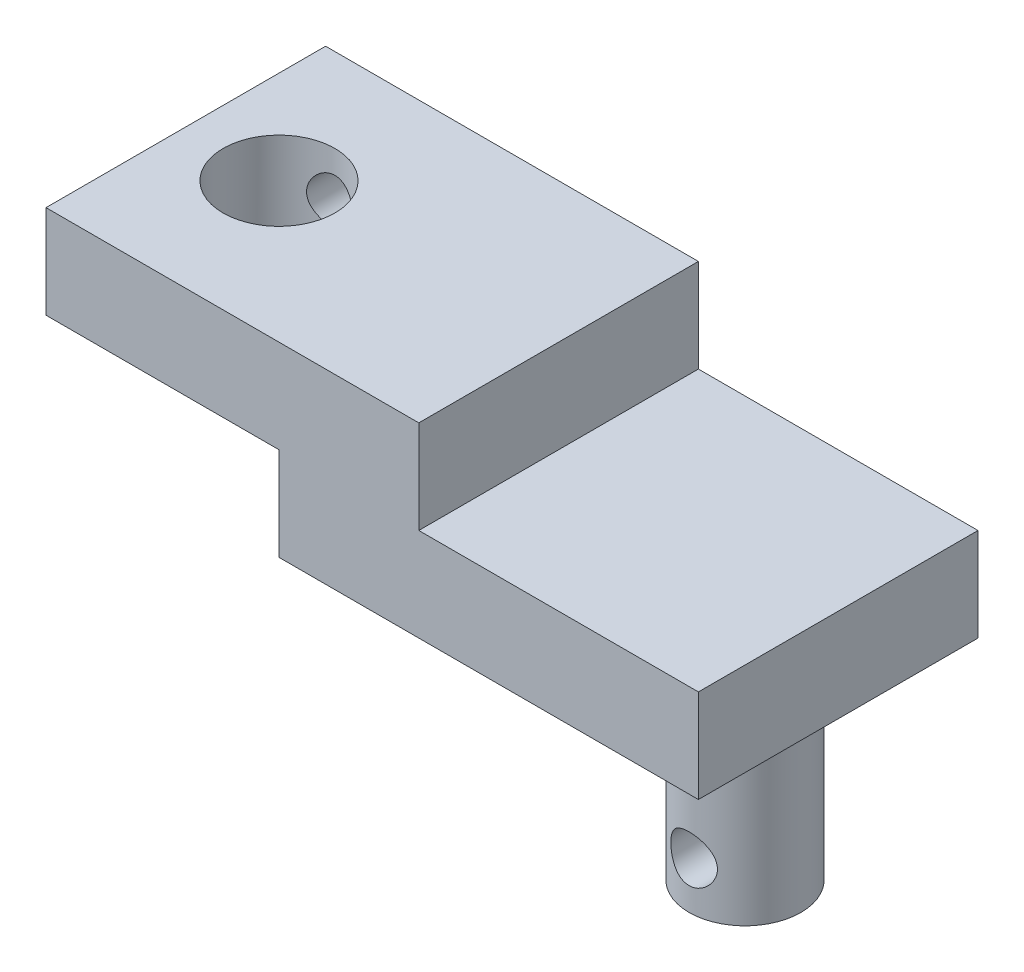
ISO-10303-21;
HEADER;
FILE_DESCRIPTION(('STEP AP214'),'2;1');
FILE_NAME('part.step','',(''),(''),'','','');
FILE_SCHEMA(('AUTOMOTIVE_DESIGN { 1 0 10303 214 1 1 1 1 }'));
ENDSEC;
DATA;
#1=APPLICATION_CONTEXT('core data for automotive mechanical design processes');
#2=APPLICATION_PROTOCOL_DEFINITION('international standard','automotive_design',2000,#1);
#3=PRODUCT_CONTEXT('',#1,'mechanical');
#4=PRODUCT('Part','Part','',(#3));
#5=PRODUCT_RELATED_PRODUCT_CATEGORY('part','',(#4));
#6=PRODUCT_DEFINITION_FORMATION('','',#4);
#7=PRODUCT_DEFINITION_CONTEXT('part definition',#1,'design');
#8=PRODUCT_DEFINITION('design','',#6,#7);
#9=PRODUCT_DEFINITION_SHAPE('','',#8);
#10=(LENGTH_UNIT() NAMED_UNIT(*) SI_UNIT(.MILLI.,.METRE.));
#11=(NAMED_UNIT(*) PLANE_ANGLE_UNIT() SI_UNIT($,.RADIAN.));
#12=(NAMED_UNIT(*) SI_UNIT($,.STERADIAN.) SOLID_ANGLE_UNIT());
#13=UNCERTAINTY_MEASURE_WITH_UNIT(LENGTH_MEASURE(1.E-05),#10,'distance_accuracy_value','');
#14=(GEOMETRIC_REPRESENTATION_CONTEXT(3) GLOBAL_UNCERTAINTY_ASSIGNED_CONTEXT((#13)) GLOBAL_UNIT_ASSIGNED_CONTEXT((#10,
#11,#12)) REPRESENTATION_CONTEXT('',''));
#15=CARTESIAN_POINT('',(0.,0.,0.));
#16=DIRECTION('',(0.,0.,1.));
#17=DIRECTION('',(1.,0.,0.));
#18=AXIS2_PLACEMENT_3D('',#15,#16,#17);
#19=CARTESIAN_POINT('',(-15.,-10.,15.));
#20=DIRECTION('',(0.,1.,0.));
#21=DIRECTION('',(0.,0.,1.));
#22=AXIS2_PLACEMENT_3D('',#19,#20,#21);
#23=PLANE('',#22);
#24=DIRECTION('',(1.,0.,0.));
#25=VECTOR('',#24,1.);
#26=CARTESIAN_POINT('',(-15.,-10.,-15.));
#27=LINE('',#26,#25);
#28=CARTESIAN_POINT('',(-15.,-10.,-15.));
#29=VERTEX_POINT('',#28);
#30=CARTESIAN_POINT('',(30.,-10.,-15.));
#31=VERTEX_POINT('',#30);
#32=EDGE_CURVE('E147',#29,#31,#27,.T.);
#33=ORIENTED_EDGE('',*,*,#32,.T.);
#34=DIRECTION('',(0.,0.,-1.));
#35=VECTOR('',#34,1.);
#36=CARTESIAN_POINT('',(30.,-10.,15.));
#37=LINE('',#36,#35);
#38=CARTESIAN_POINT('',(30.,-10.,15.));
#39=VERTEX_POINT('',#38);
#40=EDGE_CURVE('E158',#39,#31,#37,.T.);
#41=ORIENTED_EDGE('',*,*,#40,.F.);
#42=DIRECTION('',(1.,0.,0.));
#43=VECTOR('',#42,1.);
#44=CARTESIAN_POINT('',(-15.,-10.,15.));
#45=LINE('',#44,#43);
#46=CARTESIAN_POINT('',(-15.,-10.,15.));
#47=VERTEX_POINT('',#46);
#48=EDGE_CURVE('E238',#47,#39,#45,.T.);
#49=ORIENTED_EDGE('',*,*,#48,.F.);
#50=DIRECTION('',(0.,0.,-1.));
#51=VECTOR('',#50,1.);
#52=CARTESIAN_POINT('',(-15.,-10.,15.));
#53=LINE('',#52,#51);
#54=EDGE_CURVE('E161',#47,#29,#53,.T.);
#55=ORIENTED_EDGE('',*,*,#54,.T.);
#56=EDGE_LOOP('',(#33,#41,#49,#55));
#57=FACE_BOUND('',#56,.T.);
#58=CARTESIAN_POINT('',(20.,-10.,0.));
#59=DIRECTION('',(0.,1.,0.));
#60=DIRECTION('',(0.,0.,1.));
#61=AXIS2_PLACEMENT_3D('',#58,#59,#60);
#62=CIRCLE('',#61,6.);
#63=CARTESIAN_POINT('',(20.,-10.,6.));
#64=VERTEX_POINT('',#63);
#65=EDGE_CURVE('E11',#64,#64,#62,.F.);
#66=ORIENTED_EDGE('',*,*,#65,.F.);
#67=EDGE_LOOP('',(#66));
#68=FACE_BOUND('',#67,.T.);
#69=ADVANCED_FACE('F35',(#57,#68),#23,.F.);
#70=CARTESIAN_POINT('',(-40.,10.,15.));
#71=DIRECTION('',(1.,0.,0.));
#72=DIRECTION('',(0.,0.,-1.));
#73=AXIS2_PLACEMENT_3D('',#70,#71,#72);
#74=PLANE('',#73);
#75=DIRECTION('',(0.,-1.,0.));
#76=VECTOR('',#75,1.);
#77=CARTESIAN_POINT('',(-40.,10.,-15.));
#78=LINE('',#77,#76);
#79=CARTESIAN_POINT('',(-40.,10.,-15.));
#80=VERTEX_POINT('',#79);
#81=CARTESIAN_POINT('',(-40.,0.,-15.));
#82=VERTEX_POINT('',#81);
#83=EDGE_CURVE('E139',#80,#82,#78,.T.);
#84=ORIENTED_EDGE('',*,*,#83,.T.);
#85=DIRECTION('',(0.,0.,-1.));
#86=VECTOR('',#85,1.);
#87=CARTESIAN_POINT('',(-40.,0.,15.));
#88=LINE('',#87,#86);
#89=CARTESIAN_POINT('',(-40.,0.,15.));
#90=VERTEX_POINT('',#89);
#91=EDGE_CURVE('E49',#90,#82,#88,.T.);
#92=ORIENTED_EDGE('',*,*,#91,.F.);
#93=DIRECTION('',(0.,-1.,0.));
#94=VECTOR('',#93,1.);
#95=CARTESIAN_POINT('',(-40.,10.,15.));
#96=LINE('',#95,#94);
#97=CARTESIAN_POINT('',(-40.,10.,15.));
#98=VERTEX_POINT('',#97);
#99=EDGE_CURVE('E154',#98,#90,#96,.T.);
#100=ORIENTED_EDGE('',*,*,#99,.F.);
#101=DIRECTION('',(0.,0.,-1.));
#102=VECTOR('',#101,1.);
#103=CARTESIAN_POINT('',(-40.,10.,15.));
#104=LINE('',#103,#102);
#105=EDGE_CURVE('E135',#98,#80,#104,.T.);
#106=ORIENTED_EDGE('',*,*,#105,.T.);
#107=EDGE_LOOP('',(#84,#92,#100,#106));
#108=FACE_BOUND('',#107,.T.);
#109=ADVANCED_FACE('F37',(#108),#74,.F.);
#110=CARTESIAN_POINT('',(-40.,0.,15.));
#111=DIRECTION('',(0.,1.,0.));
#112=DIRECTION('',(-1.,0.,0.));
#113=AXIS2_PLACEMENT_3D('',#110,#111,#112);
#114=PLANE('',#113);
#115=CARTESIAN_POINT('',(-30.,0.,0.));
#116=DIRECTION('',(0.,1.,0.));
#117=DIRECTION('',(-1.,0.,0.));
#118=AXIS2_PLACEMENT_3D('',#115,#116,#117);
#119=CIRCLE('',#118,6.);
#120=CARTESIAN_POINT('',(-36.,0.,0.));
#121=VERTEX_POINT('',#120);
#122=EDGE_CURVE('E143',#121,#121,#119,.F.);
#123=ORIENTED_EDGE('',*,*,#122,.F.);
#124=EDGE_LOOP('',(#123));
#125=FACE_BOUND('',#124,.T.);
#126=DIRECTION('',(1.,0.,0.));
#127=VECTOR('',#126,1.);
#128=CARTESIAN_POINT('',(-40.,0.,-15.));
#129=LINE('',#128,#127);
#130=CARTESIAN_POINT('',(-15.,0.,-15.));
#131=VERTEX_POINT('',#130);
#132=EDGE_CURVE('E142',#82,#131,#129,.T.);
#133=ORIENTED_EDGE('',*,*,#132,.T.);
#134=DIRECTION('',(0.,0.,-1.));
#135=VECTOR('',#134,1.);
#136=CARTESIAN_POINT('',(-15.,0.,15.));
#137=LINE('',#136,#135);
#138=CARTESIAN_POINT('',(-15.,0.,15.));
#139=VERTEX_POINT('',#138);
#140=EDGE_CURVE('E164',#139,#131,#137,.T.);
#141=ORIENTED_EDGE('',*,*,#140,.F.);
#142=DIRECTION('',(1.,0.,0.));
#143=VECTOR('',#142,1.);
#144=CARTESIAN_POINT('',(-40.,0.,15.));
#145=LINE('',#144,#143);
#146=EDGE_CURVE('E102',#90,#139,#145,.T.);
#147=ORIENTED_EDGE('',*,*,#146,.F.);
#148=ORIENTED_EDGE('',*,*,#91,.T.);
#149=EDGE_LOOP('',(#133,#141,#147,#148));
#150=FACE_BOUND('',#149,.T.);
#151=ADVANCED_FACE('F210',(#125,#150),#114,.F.);
#152=CARTESIAN_POINT('',(-15.,0.,15.));
#153=DIRECTION('',(1.,0.,0.));
#154=DIRECTION('',(0.,1.,0.));
#155=AXIS2_PLACEMENT_3D('',#152,#153,#154);
#156=PLANE('',#155);
#157=DIRECTION('',(0.,-1.,0.));
#158=VECTOR('',#157,1.);
#159=CARTESIAN_POINT('',(-15.,0.,-15.));
#160=LINE('',#159,#158);
#161=EDGE_CURVE('E145',#131,#29,#160,.T.);
#162=ORIENTED_EDGE('',*,*,#161,.T.);
#163=ORIENTED_EDGE('',*,*,#54,.F.);
#164=DIRECTION('',(0.,-1.,0.));
#165=VECTOR('',#164,1.);
#166=CARTESIAN_POINT('',(-15.,0.,15.));
#167=LINE('',#166,#165);
#168=EDGE_CURVE('E232',#139,#47,#167,.T.);
#169=ORIENTED_EDGE('',*,*,#168,.F.);
#170=ORIENTED_EDGE('',*,*,#140,.T.);
#171=EDGE_LOOP('',(#162,#163,#169,#170));
#172=FACE_BOUND('',#171,.T.);
#173=ADVANCED_FACE('F217',(#172),#156,.F.);
#174=CARTESIAN_POINT('',(30.,0.,15.));
#175=DIRECTION('',(-1.,0.,0.));
#176=DIRECTION('',(0.,0.,1.));
#177=AXIS2_PLACEMENT_3D('',#174,#175,#176);
#178=PLANE('',#177);
#179=DIRECTION('',(0.,1.,0.));
#180=VECTOR('',#179,1.);
#181=CARTESIAN_POINT('',(30.,0.,-15.));
#182=LINE('',#181,#180);
#183=CARTESIAN_POINT('',(30.,0.,-15.));
#184=VERTEX_POINT('',#183);
#185=EDGE_CURVE('E149',#31,#184,#182,.T.);
#186=ORIENTED_EDGE('',*,*,#185,.T.);
#187=DIRECTION('',(0.,0.,-1.));
#188=VECTOR('',#187,1.);
#189=CARTESIAN_POINT('',(30.,0.,15.));
#190=LINE('',#189,#188);
#191=CARTESIAN_POINT('',(30.,0.,15.));
#192=VERTEX_POINT('',#191);
#193=EDGE_CURVE('E130',#192,#184,#190,.T.);
#194=ORIENTED_EDGE('',*,*,#193,.F.);
#195=DIRECTION('',(0.,1.,0.));
#196=VECTOR('',#195,1.);
#197=CARTESIAN_POINT('',(30.,0.,15.));
#198=LINE('',#197,#196);
#199=EDGE_CURVE('E121',#39,#192,#198,.T.);
#200=ORIENTED_EDGE('',*,*,#199,.F.);
#201=ORIENTED_EDGE('',*,*,#40,.T.);
#202=EDGE_LOOP('',(#186,#194,#200,#201));
#203=FACE_BOUND('',#202,.T.);
#204=ADVANCED_FACE('F215',(#203),#178,.F.);
#205=CARTESIAN_POINT('',(0.,0.,15.));
#206=DIRECTION('',(0.,-1.,0.));
#207=DIRECTION('',(0.,0.,-1.));
#208=AXIS2_PLACEMENT_3D('',#205,#206,#207);
#209=PLANE('',#208);
#210=DIRECTION('',(-1.,0.,0.));
#211=VECTOR('',#210,1.);
#212=CARTESIAN_POINT('',(0.,0.,-15.));
#213=LINE('',#212,#211);
#214=CARTESIAN_POINT('',(0.,0.,-15.));
#215=VERTEX_POINT('',#214);
#216=EDGE_CURVE('E129',#184,#215,#213,.T.);
#217=ORIENTED_EDGE('',*,*,#216,.T.);
#218=DIRECTION('',(0.,0.,-1.));
#219=VECTOR('',#218,1.);
#220=CARTESIAN_POINT('',(0.,0.,15.));
#221=LINE('',#220,#219);
#222=CARTESIAN_POINT('',(0.,0.,15.));
#223=VERTEX_POINT('',#222);
#224=EDGE_CURVE('E126',#223,#215,#221,.T.);
#225=ORIENTED_EDGE('',*,*,#224,.F.);
#226=DIRECTION('',(-1.,0.,0.));
#227=VECTOR('',#226,1.);
#228=CARTESIAN_POINT('',(0.,0.,15.));
#229=LINE('',#228,#227);
#230=EDGE_CURVE('E115',#192,#223,#229,.T.);
#231=ORIENTED_EDGE('',*,*,#230,.F.);
#232=ORIENTED_EDGE('',*,*,#193,.T.);
#233=EDGE_LOOP('',(#217,#225,#231,#232));
#234=FACE_BOUND('',#233,.T.);
#235=ADVANCED_FACE('F127',(#234),#209,.F.);
#236=CARTESIAN_POINT('',(0.,10.,15.));
#237=DIRECTION('',(-1.,0.,0.));
#238=DIRECTION('',(0.,-1.,0.));
#239=AXIS2_PLACEMENT_3D('',#236,#237,#238);
#240=PLANE('',#239);
#241=DIRECTION('',(0.,1.,0.));
#242=VECTOR('',#241,1.);
#243=CARTESIAN_POINT('',(0.,10.,-15.));
#244=LINE('',#243,#242);
#245=CARTESIAN_POINT('',(0.,10.,-15.));
#246=VERTEX_POINT('',#245);
#247=EDGE_CURVE('E87',#215,#246,#244,.T.);
#248=ORIENTED_EDGE('',*,*,#247,.T.);
#249=DIRECTION('',(0.,0.,-1.));
#250=VECTOR('',#249,1.);
#251=CARTESIAN_POINT('',(0.,10.,15.));
#252=LINE('',#251,#250);
#253=CARTESIAN_POINT('',(0.,10.,15.));
#254=VERTEX_POINT('',#253);
#255=EDGE_CURVE('E131',#254,#246,#252,.T.);
#256=ORIENTED_EDGE('',*,*,#255,.F.);
#257=DIRECTION('',(0.,1.,0.));
#258=VECTOR('',#257,1.);
#259=CARTESIAN_POINT('',(0.,10.,15.));
#260=LINE('',#259,#258);
#261=EDGE_CURVE('E119',#223,#254,#260,.T.);
#262=ORIENTED_EDGE('',*,*,#261,.F.);
#263=ORIENTED_EDGE('',*,*,#224,.T.);
#264=EDGE_LOOP('',(#248,#256,#262,#263));
#265=FACE_BOUND('',#264,.T.);
#266=ADVANCED_FACE('F133',(#265),#240,.F.);
#267=CARTESIAN_POINT('',(-40.,10.,15.));
#268=DIRECTION('',(0.,-1.,0.));
#269=DIRECTION('',(0.,0.,-1.));
#270=AXIS2_PLACEMENT_3D('',#267,#268,#269);
#271=PLANE('',#270);
#272=CARTESIAN_POINT('',(-30.,10.,0.));
#273=DIRECTION('',(0.,1.,0.));
#274=DIRECTION('',(0.,0.,1.));
#275=AXIS2_PLACEMENT_3D('',#272,#273,#274);
#276=CIRCLE('',#275,6.);
#277=CARTESIAN_POINT('',(-30.,10.,6.));
#278=VERTEX_POINT('',#277);
#279=EDGE_CURVE('E245',#278,#278,#276,.T.);
#280=ORIENTED_EDGE('',*,*,#279,.F.);
#281=EDGE_LOOP('',(#280));
#282=FACE_BOUND('',#281,.T.);
#283=DIRECTION('',(-1.,0.,0.));
#284=VECTOR('',#283,1.);
#285=CARTESIAN_POINT('',(-40.,10.,-15.));
#286=LINE('',#285,#284);
#287=EDGE_CURVE('E93',#246,#80,#286,.T.);
#288=ORIENTED_EDGE('',*,*,#287,.T.);
#289=ORIENTED_EDGE('',*,*,#105,.F.);
#290=DIRECTION('',(-1.,0.,0.));
#291=VECTOR('',#290,1.);
#292=CARTESIAN_POINT('',(-40.,10.,15.));
#293=LINE('',#292,#291);
#294=EDGE_CURVE('E58',#254,#98,#293,.T.);
#295=ORIENTED_EDGE('',*,*,#294,.F.);
#296=ORIENTED_EDGE('',*,*,#255,.T.);
#297=EDGE_LOOP('',(#288,#289,#295,#296));
#298=FACE_BOUND('',#297,.T.);
#299=ADVANCED_FACE('F302',(#282,#298),#271,.F.);
#300=CARTESIAN_POINT('',(0.,0.,15.));
#301=DIRECTION('',(0.,0.,1.));
#302=DIRECTION('',(1.,0.,0.));
#303=AXIS2_PLACEMENT_3D('',#300,#301,#302);
#304=PLANE('',#303);
#305=ORIENTED_EDGE('',*,*,#99,.T.);
#306=ORIENTED_EDGE('',*,*,#146,.T.);
#307=ORIENTED_EDGE('',*,*,#168,.T.);
#308=ORIENTED_EDGE('',*,*,#48,.T.);
#309=ORIENTED_EDGE('',*,*,#199,.T.);
#310=ORIENTED_EDGE('',*,*,#230,.T.);
#311=ORIENTED_EDGE('',*,*,#261,.T.);
#312=ORIENTED_EDGE('',*,*,#294,.T.);
#313=EDGE_LOOP('',(#305,#306,#307,#308,#309,#310,#311,#312));
#314=FACE_BOUND('',#313,.T.);
#315=ADVANCED_FACE('F117',(#314),#304,.T.);
#316=CARTESIAN_POINT('',(0.,0.,-15.));
#317=DIRECTION('',(0.,0.,1.));
#318=DIRECTION('',(1.,0.,0.));
#319=AXIS2_PLACEMENT_3D('',#316,#317,#318);
#320=PLANE('',#319);
#321=CARTESIAN_POINT('',(-30.,5.,-15.));
#322=DIRECTION('',(0.,0.,1.));
#323=DIRECTION('',(1.,0.,0.));
#324=AXIS2_PLACEMENT_3D('',#321,#322,#323);
#325=CIRCLE('',#324,2.5);
#326=CARTESIAN_POINT('',(-27.5,5.,-15.));
#327=VERTEX_POINT('',#326);
#328=EDGE_CURVE('E175',#327,#327,#325,.T.);
#329=ORIENTED_EDGE('',*,*,#328,.T.);
#330=EDGE_LOOP('',(#329));
#331=FACE_BOUND('',#330,.T.);
#332=ORIENTED_EDGE('',*,*,#83,.F.);
#333=ORIENTED_EDGE('',*,*,#287,.F.);
#334=ORIENTED_EDGE('',*,*,#247,.F.);
#335=ORIENTED_EDGE('',*,*,#216,.F.);
#336=ORIENTED_EDGE('',*,*,#185,.F.);
#337=ORIENTED_EDGE('',*,*,#32,.F.);
#338=ORIENTED_EDGE('',*,*,#161,.F.);
#339=ORIENTED_EDGE('',*,*,#132,.F.);
#340=EDGE_LOOP('',(#332,#333,#334,#335,#336,#337,#338,#339));
#341=FACE_BOUND('',#340,.T.);
#342=ADVANCED_FACE('F200',(#331,#341),#320,.F.);
#343=CARTESIAN_POINT('',(-30.,-10.001,0.));
#344=DIRECTION('',(0.,1.,0.));
#345=DIRECTION('',(0.,0.,1.));
#346=AXIS2_PLACEMENT_3D('',#343,#344,#345);
#347=CYLINDRICAL_SURFACE('',#346,6.);
#348=CARTESIAN_POINT('',(-27.5,5.,-5.45435605731786));
#349=CARTESIAN_POINT('',(-27.5000014997408,4.9332918168451,-5.45435734054166));
#350=CARTESIAN_POINT('',(-27.5026755046111,4.86656520783146,-5.45558543289999));
#351=CARTESIAN_POINT('',(-27.5133358351441,4.73361352159701,-5.460451257595));
#352=CARTESIAN_POINT('',(-27.5213253178979,4.66738876610491,-5.46409042196574));
#353=CARTESIAN_POINT('',(-27.5532073406841,4.46994813322944,-5.47848490817198));
#354=CARTESIAN_POINT('',(-27.5850131659176,4.34016318357051,-5.49271671920563));
#355=CARTESIAN_POINT('',(-27.668199986624,4.08884523586875,-5.52853615769555));
#356=CARTESIAN_POINT('',(-27.719501185614,3.9672809479084,-5.55009376241033));
#357=CARTESIAN_POINT('',(-27.8399873106526,3.73448982344301,-5.59808356001864));
#358=CARTESIAN_POINT('',(-27.9091680062346,3.62326055002321,-5.62451459938573));
#359=CARTESIAN_POINT('',(-28.068052215563,3.40734601791058,-5.68111508149861));
#360=CARTESIAN_POINT('',(-28.1586935185094,3.30338420295254,-5.71141131571832));
#361=CARTESIAN_POINT('',(-28.3559566536327,3.11160023482553,-5.77128595332676));
#362=CARTESIAN_POINT('',(-28.4625846186517,3.02378430448885,-5.80086407614999));
#363=CARTESIAN_POINT('',(-28.6944732109449,2.86310074447136,-5.8575107455344));
#364=CARTESIAN_POINT('',(-28.8203414122421,2.79104669211854,-5.88441479600861));
#365=CARTESIAN_POINT('',(-29.0837359556657,2.66944801078252,-5.93113040336416));
#366=CARTESIAN_POINT('',(-29.2212570903577,2.61989338960259,-5.95094510785638));
#367=CARTESIAN_POINT('',(-29.496463003853,2.54732106965965,-5.98035041998161));
#368=CARTESIAN_POINT('',(-29.633766847582,2.52305660676678,-5.99041942231785));
#369=CARTESIAN_POINT('',(-29.9108416392958,2.49772472110802,-6.00093657245546));
#370=CARTESIAN_POINT('',(-30.0506115635358,2.49664788912578,-6.00138862268061));
#371=CARTESIAN_POINT('',(-30.3195855602188,2.51706856102921,-5.99290258260449));
#372=CARTESIAN_POINT('',(-30.4489149772129,2.53719620082689,-5.98453429295767));
#373=CARTESIAN_POINT('',(-30.7021657878646,2.59710620550091,-5.96013033502178));
#374=CARTESIAN_POINT('',(-30.8260867821104,2.63689001932116,-5.94409410149731));
#375=CARTESIAN_POINT('',(-31.0672762361544,2.73545608172753,-5.90559704827471));
#376=CARTESIAN_POINT('',(-31.1844143541491,2.79451892572424,-5.88304194251414));
#377=CARTESIAN_POINT('',(-31.4074235345647,2.9296915134181,-5.83371427980366));
#378=CARTESIAN_POINT('',(-31.5132905955162,3.00580728169785,-5.80694023334947));
#379=CARTESIAN_POINT('',(-31.7186818234134,3.1791648408008,-5.74963397551512));
#380=CARTESIAN_POINT('',(-31.8172328746232,3.27751758254305,-5.71896988702081));
#381=CARTESIAN_POINT('',(-31.9968628298646,3.48942288142814,-5.65875721372881));
#382=CARTESIAN_POINT('',(-32.0779349916834,3.60298127663566,-5.62920906299901));
#383=CARTESIAN_POINT('',(-32.2228037849707,3.84679007327972,-5.57363224672087));
#384=CARTESIAN_POINT('',(-32.285945066984,3.9774664113055,-5.54775116967603));
#385=CARTESIAN_POINT('',(-32.3889286410396,4.24896208976257,-5.50419688296717));
#386=CARTESIAN_POINT('',(-32.4287875925124,4.38977409648425,-5.48651780631503));
#387=CARTESIAN_POINT('',(-32.4816005033918,4.66779361786699,-5.46282425074791));
#388=CARTESIAN_POINT('',(-32.4961322926652,4.80464224452852,-5.45612738403682));
#389=CARTESIAN_POINT('',(-32.5025126103721,5.07895696481259,-5.45320573611839));
#390=CARTESIAN_POINT('',(-32.4943689863609,5.21642282838074,-5.45697733196184));
#391=CARTESIAN_POINT('',(-32.457069551313,5.4787967708634,-5.47386262693794));
#392=CARTESIAN_POINT('',(-32.4292923763615,5.60394537357419,-5.48636276033852));
#393=CARTESIAN_POINT('',(-32.355341171284,5.84770259299516,-5.51851260594277));
#394=CARTESIAN_POINT('',(-32.3091628410624,5.96630967366157,-5.53816398920152));
#395=CARTESIAN_POINT('',(-32.1975504161039,6.19923062071278,-5.58341595714177));
#396=CARTESIAN_POINT('',(-32.1313836661239,6.31314994921936,-5.60923324404617));
#397=CARTESIAN_POINT('',(-31.982401568772,6.52881610499933,-5.66360007481535));
#398=CARTESIAN_POINT('',(-31.8995790157522,6.63055763340873,-5.69215079841132));
#399=CARTESIAN_POINT('',(-31.7116889114307,6.82760026976261,-5.75157239569101));
#400=CARTESIAN_POINT('',(-31.6053593229584,6.92170279988034,-5.78244293417774));
#401=CARTESIAN_POINT('',(-31.3777030251082,7.09094458397963,-5.84086722367755));
#402=CARTESIAN_POINT('',(-31.2563752176113,7.1660824482059,-5.86842073153699));
#403=CARTESIAN_POINT('',(-31.0013093616027,7.29517975080845,-5.91728503171628));
#404=CARTESIAN_POINT('',(-30.8675403392619,7.34908448228483,-5.93857966278875));
#405=CARTESIAN_POINT('',(-30.5917176703239,7.43323358496282,-5.9723634620551));
#406=CARTESIAN_POINT('',(-30.4496690085068,7.463492037549,-5.98485787035281));
#407=CARTESIAN_POINT('',(-30.1720330669604,7.49771625002041,-5.9990306959926));
#408=CARTESIAN_POINT('',(-30.0366881693984,7.50337199571005,-6.0014040908376));
#409=CARTESIAN_POINT('',(-29.7670263767608,7.49277372109535,-5.99699046946599));
#410=CARTESIAN_POINT('',(-29.6327093056225,7.47652354168605,-5.99020505911644));
#411=CARTESIAN_POINT('',(-29.3738270344218,7.4237878424573,-5.96860132018429));
#412=CARTESIAN_POINT('',(-29.2490849218179,7.38804059052424,-5.9540764862017));
#413=CARTESIAN_POINT('',(-29.0074155414928,7.29813155412762,-5.91858999492374));
#414=CARTESIAN_POINT('',(-28.8904897633309,7.24396627164176,-5.89762711496349));
#415=CARTESIAN_POINT('',(-28.6619508593195,7.11602075242075,-5.85011651583377));
#416=CARTESIAN_POINT('',(-28.550816647002,7.04146467648695,-5.82335921372399));
#417=CARTESIAN_POINT('',(-28.3421626857808,6.87598635518927,-5.7674312075248));
#418=CARTESIAN_POINT('',(-28.2446480149589,6.78505803416387,-5.73825960968076));
#419=CARTESIAN_POINT('',(-28.0591002775771,6.58210746992791,-5.67829702479813));
#420=CARTESIAN_POINT('',(-27.9721639230064,6.46907088797005,-5.64753091772368));
#421=CARTESIAN_POINT('',(-27.8183339242452,6.22909360799927,-5.5899105903639));
#422=CARTESIAN_POINT('',(-27.7514514841625,6.10214519133264,-5.56305856115973));
#423=CARTESIAN_POINT('',(-27.640342557358,5.83807106664053,-5.51685287460303));
#424=CARTESIAN_POINT('',(-27.595995627413,5.70100404485043,-5.49745949216625));
#425=CARTESIAN_POINT('',(-27.5476007464922,5.49083623093362,-5.47594959049764));
#426=CARTESIAN_POINT('',(-27.5344939665219,5.42008940204395,-5.47004503557757));
#427=CARTESIAN_POINT('',(-27.5144186905607,5.27757394358142,-5.46095373466208));
#428=CARTESIAN_POINT('',(-27.507445859756,5.20580607207738,-5.45776506941946));
#429=CARTESIAN_POINT('',(-27.5011952032918,5.08928839436097,-5.45490391727668));
#430=CARTESIAN_POINT('',(-27.4999989962114,5.0446483243266,-5.45435519844583));
#431=CARTESIAN_POINT('',(-27.5,5.,-5.45435605731786));
#432=B_SPLINE_CURVE_WITH_KNOTS('',3,(#348,#349,#350,#351,#352,#353,#354,#355,#356,#357,#358,
#359,#360,#361,#362,#363,#364,#365,#366,#367,#368,#369,#370,#371,#372,#373,#374,#375,#376,#377,
#378,#379,#380,#381,#382,#383,#384,#385,#386,#387,#388,#389,#390,#391,#392,#393,#394,#395,#396,
#397,#398,#399,#400,#401,#402,#403,#404,#405,#406,#407,#408,#409,#410,#411,#412,#413,#414,#415,
#416,#417,#418,#419,#420,#421,#422,#423,#424,#425,#426,#427,#428,#429,#430,#431),.UNSPECIFIED.,
.T.,.F.,(4,2,2,2,2,2,2,2,2,2,2,2,2,2,2,2,2,2,2,2,2,2,2,2,2,2,2,2,2,2,2,2,2,2,2,2,2,2,2,2,2,4),
(0.,0.200084575093045,0.400288095243581,0.801278994956903,1.20064597557678,1.59991854837275,
2.02172149988563,2.44368668047076,2.88395420283103,3.32402600677037,3.74119679083159,
4.15819828963116,4.54982147617441,4.94147353531023,5.33910096407387,5.73686909172224,
6.16267530816224,6.58864548009988,7.02861558463919,7.46827048625634,7.87940023747111,
8.29038772171393,8.6750626926688,9.05982760961555,9.46088720770834,9.86212068725427,
10.2960179260552,10.7299469521823,11.1649867904569,11.5997673642051,12.004157373226,
12.4084764873832,12.7984529720747,13.1885035639884,13.5961819279257,14.004011892323,
14.4395932095167,14.8754174341574,15.3088871873109,15.5252058174741,15.7413714538654,
15.8752896716763),.UNSPECIFIED.);
#433=CARTESIAN_POINT('',(-27.5,5.,-5.45435605731786));
#434=VERTEX_POINT('',#433);
#435=EDGE_CURVE('E168',#434,#434,#432,.T.);
#436=ORIENTED_EDGE('',*,*,#435,.T.);
#437=EDGE_LOOP('',(#436));
#438=FACE_BOUND('',#437,.T.);
#439=ORIENTED_EDGE('',*,*,#279,.T.);
#440=EDGE_LOOP('',(#439));
#441=FACE_BOUND('',#440,.T.);
#442=ORIENTED_EDGE('',*,*,#122,.T.);
#443=EDGE_LOOP('',(#442));
#444=FACE_BOUND('',#443,.T.);
#445=ADVANCED_FACE('F179',(#438,#441,#444),#347,.F.);
#446=CARTESIAN_POINT('',(20.,-30.,0.));
#447=DIRECTION('',(0.,1.,0.));
#448=DIRECTION('',(0.,0.,1.));
#449=AXIS2_PLACEMENT_3D('',#446,#447,#448);
#450=CYLINDRICAL_SURFACE('',#449,6.);
#451=CARTESIAN_POINT('',(20.,-27.5,6.));
#452=CARTESIAN_POINT('',(19.8660960818362,-27.4999952878604,5.99999628290906));
#453=CARTESIAN_POINT('',(19.7319604750086,-27.4891786843995,5.99546656821164));
#454=CARTESIAN_POINT('',(19.4675019800089,-27.4463192619064,5.97780115788616));
#455=CARTESIAN_POINT('',(19.3371899701913,-27.4142210532185,5.96464300599791));
#456=CARTESIAN_POINT('',(19.0846234067008,-27.3301785119407,5.93112629106012));
#457=CARTESIAN_POINT('',(18.9623431856562,-27.2783014076769,5.91079213642029));
#458=CARTESIAN_POINT('',(18.7283402522027,-27.1564541669781,5.8649055925345));
#459=CARTESIAN_POINT('',(18.6166143558371,-27.0864895110252,5.83935478441347));
#460=CARTESIAN_POINT('',(18.401103259954,-26.9267420881924,5.78415660619864));
#461=CARTESIAN_POINT('',(18.2979174829696,-26.8361973967483,5.75437507703432));
#462=CARTESIAN_POINT('',(18.1076803398029,-26.6394713160995,5.69465427085228));
#463=CARTESIAN_POINT('',(18.0206374687601,-26.5332817462849,5.66471491925558));
#464=CARTESIAN_POINT('',(17.8609252512352,-26.3019464489895,5.60642043928224));
#465=CARTESIAN_POINT('',(17.7891738383059,-26.1761251042486,5.57821573827599));
#466=CARTESIAN_POINT('',(17.668121186839,-25.912853483057,5.52871144633222));
#467=CARTESIAN_POINT('',(17.618808382912,-25.7754092407429,5.50740829980501));
#468=CARTESIAN_POINT('',(17.5465080341015,-25.4996926167385,5.47557110795536));
#469=CARTESIAN_POINT('',(17.52236684254,-25.361779033289,5.46456775308951));
#470=CARTESIAN_POINT('',(17.497495800552,-25.0834534145536,5.45322652433633));
#471=CARTESIAN_POINT('',(17.4967530388883,-24.9430427999296,5.45288276849132));
#472=CARTESIAN_POINT('',(17.5178309927485,-24.6751998791476,5.46250239122985));
#473=CARTESIAN_POINT('',(17.5379263777599,-24.5475978068757,5.47167765447588));
#474=CARTESIAN_POINT('',(17.5972161796786,-24.2977758179945,5.49796965547249));
#475=CARTESIAN_POINT('',(17.6364142542549,-24.1755569370152,5.51508791407034));
#476=CARTESIAN_POINT('',(17.7335608254502,-23.9368845940184,5.55572369545608));
#477=CARTESIAN_POINT('',(17.7918905692157,-23.8206091581736,5.57936963898298));
#478=CARTESIAN_POINT('',(17.9253751483883,-23.5990445322394,5.63036662282146));
#479=CARTESIAN_POINT('',(18.0005366189608,-23.4937596987729,5.65771912259552));
#480=CARTESIAN_POINT('',(18.1730080689125,-23.2878000825344,5.71585953755966));
#481=CARTESIAN_POINT('',(18.271653033585,-23.1882668652292,5.74674242808947));
#482=CARTESIAN_POINT('',(18.4845408178969,-23.0067729940816,5.80651346225056));
#483=CARTESIAN_POINT('',(18.5987872811031,-22.9248164566156,5.83540113754019));
#484=CARTESIAN_POINT('',(18.8431041026133,-22.7791283527675,5.88876567112946));
#485=CARTESIAN_POINT('',(18.9734788351046,-22.7158611096986,5.91312533086667));
#486=CARTESIAN_POINT('',(19.2442951949463,-22.6125577207935,5.95378962829606));
#487=CARTESIAN_POINT('',(19.3847312104099,-22.5725087361124,5.970098716916));
#488=CARTESIAN_POINT('',(19.6621437733075,-22.5191680157467,5.9919928237277));
#489=CARTESIAN_POINT('',(19.7987774294427,-22.5043442851125,5.9981908209425));
#490=CARTESIAN_POINT('',(20.0727093109922,-22.4973075527718,6.00112100737489));
#491=CARTESIAN_POINT('',(20.2100073343053,-22.505088059496,5.99785591423878));
#492=CARTESIAN_POINT('',(20.4741964846829,-22.5419421696121,5.9826243531388));
#493=CARTESIAN_POINT('',(20.6012659332788,-22.5699399081944,5.97109774567979));
#494=CARTESIAN_POINT('',(20.8487654979422,-22.6449363890816,5.94097213544828));
#495=CARTESIAN_POINT('',(20.9691947730367,-22.6919375319006,5.92237223919408));
#496=CARTESIAN_POINT('',(21.2042179997383,-22.8051419514242,5.8791654129033));
#497=CARTESIAN_POINT('',(21.3185144737107,-22.871896366292,5.8543898293856));
#498=CARTESIAN_POINT('',(21.5346924324628,-23.0221067555834,5.80147609158182));
#499=CARTESIAN_POINT('',(21.6365687052037,-23.1055697030586,5.77333653537473));
#500=CARTESIAN_POINT('',(21.8326668605487,-23.2938064665447,5.71424175790867));
#501=CARTESIAN_POINT('',(21.9258213959602,-23.3996770059721,5.68322903182028));
#502=CARTESIAN_POINT('',(22.0933396922105,-23.6260425518712,5.6236867353604));
#503=CARTESIAN_POINT('',(22.1676991857103,-23.746540870345,5.59515772986987));
#504=CARTESIAN_POINT('',(22.2963192041761,-24.0012283506036,5.54362772487864));
#505=CARTESIAN_POINT('',(22.3502783647545,-24.1355880710237,5.52071125109802));
#506=CARTESIAN_POINT('',(22.4343482790235,-24.4127411876261,5.48416711318334));
#507=CARTESIAN_POINT('',(22.4644786972442,-24.5555275249888,5.47053179113073));
#508=CARTESIAN_POINT('',(22.4980816070053,-24.8336373983781,5.45526329073079));
#509=CARTESIAN_POINT('',(22.5034276083608,-24.9686893245119,5.45278701929113));
#510=CARTESIAN_POINT('',(22.49231151038,-25.2376857223555,5.45787706027259));
#511=CARTESIAN_POINT('',(22.4758527589288,-25.3716303609001,5.46544183100007));
#512=CARTESIAN_POINT('',(22.4231680959584,-25.6281854946778,5.48899102586044));
#513=CARTESIAN_POINT('',(22.387898072702,-25.7510333459775,5.50456709625453));
#514=CARTESIAN_POINT('',(22.2995265627696,-25.989096043664,5.54206362465904));
#515=CARTESIAN_POINT('',(22.2464200656009,-26.104308734336,5.56398586515028));
#516=CARTESIAN_POINT('',(22.1202057237392,-26.331391788147,5.61333908853253));
#517=CARTESIAN_POINT('',(22.0460872375014,-26.4426446459478,5.64102204404079));
#518=CARTESIAN_POINT('',(21.8813681259624,-26.6517202931151,5.69807379131313));
#519=CARTESIAN_POINT('',(21.7907617856372,-26.7495384050324,5.72744316520043));
#520=CARTESIAN_POINT('',(21.5878041689884,-26.9362973056175,5.78712781593092));
#521=CARTESIAN_POINT('',(21.4743497786881,-27.0240726428278,5.81735619175009));
#522=CARTESIAN_POINT('',(21.2331998595804,-27.1793991300421,5.87320303099821));
#523=CARTESIAN_POINT('',(21.1054978774169,-27.2469410639968,5.89881939160172));
#524=CARTESIAN_POINT('',(20.8414652134222,-27.3584188704516,5.94218308378895));
#525=CARTESIAN_POINT('',(20.7053120564159,-27.4027264942901,5.96005349044659));
#526=CARTESIAN_POINT('',(20.4268167820703,-27.4674156875296,5.9864223497589));
#527=CARTESIAN_POINT('',(20.284495506122,-27.4878721682058,5.99495014042422));
#528=CARTESIAN_POINT('',(20.1180525123494,-27.4973238417862,5.99888566614291));
#529=CARTESIAN_POINT('',(20.0944569348794,-27.498326602503,5.99930292614997));
#530=CARTESIAN_POINT('',(20.0472433090693,-27.4996650982568,5.99986042138656));
#531=CARTESIAN_POINT('',(20.0236252606651,-27.5000008313836,6.0000006558228));
#532=CARTESIAN_POINT('',(20.,-27.5,6.));
#533=B_SPLINE_CURVE_WITH_KNOTS('',3,(#451,#452,#453,#454,#455,#456,#457,#458,#459,#460,#461,
#462,#463,#464,#465,#466,#467,#468,#469,#470,#471,#472,#473,#474,#475,#476,#477,#478,#479,#480,
#481,#482,#483,#484,#485,#486,#487,#488,#489,#490,#491,#492,#493,#494,#495,#496,#497,#498,#499,
#500,#501,#502,#503,#504,#505,#506,#507,#508,#509,#510,#511,#512,#513,#514,#515,#516,#517,#518,
#519,#520,#521,#522,#523,#524,#525,#526,#527,#528,#529,#530,#531,#532),.UNSPECIFIED.,.T.,.F.,(4,
2,2,2,2,2,2,2,2,2,2,2,2,2,2,2,2,2,2,2,2,2,2,2,2,2,2,2,2,2,2,2,2,2,2,2,2,2,2,2,4),(0.,
0.401613837767878,0.804277081257394,1.2055837038126,1.60676887370595,2.02635872577614,
2.44616876262931,2.88663449078251,3.32687293461176,3.74590546275115,4.16470676498092,
4.55140314405113,4.93817359454426,5.33317426117429,5.72833091434413,6.15688282255793,
6.58553498629176,7.02408110121626,7.46238448436594,7.87296886786502,8.28343534986344,
8.67353179471442,9.0636775320357,9.46594270544322,9.86837610938991,10.2995697605859,
10.7308612248068,11.1682957671905,11.6053689414916,12.0087975511929,12.4121642259507,
12.7967529992952,13.1814498990122,13.5892778679488,13.9972474685189,14.4349307000978,
14.8728129885717,15.3034571163877,15.7327450093864,15.8036033125921,15.8744618187069),.UNSPECIFIED.);
#534=CARTESIAN_POINT('',(20.,-27.5,6.));
#535=VERTEX_POINT('',#534);
#536=EDGE_CURVE('E39',#535,#535,#533,.T.);
#537=ORIENTED_EDGE('',*,*,#536,.T.);
#538=EDGE_LOOP('',(#537));
#539=FACE_BOUND('',#538,.T.);
#540=CARTESIAN_POINT('',(17.5,-25.,-5.45435605731786));
#541=CARTESIAN_POINT('',(17.5000014997408,-25.0667081831549,-5.45435734054166));
#542=CARTESIAN_POINT('',(17.5026755046111,-25.1334347921685,-5.45558543289999));
#543=CARTESIAN_POINT('',(17.5133358351441,-25.266386478403,-5.460451257595));
#544=CARTESIAN_POINT('',(17.5213253178979,-25.3326112338951,-5.46409042196574));
#545=CARTESIAN_POINT('',(17.5532073406841,-25.5300518667706,-5.47848490817198));
#546=CARTESIAN_POINT('',(17.5850131659176,-25.6598368164295,-5.49271671920563));
#547=CARTESIAN_POINT('',(17.668199986624,-25.9111547641313,-5.52853615769555));
#548=CARTESIAN_POINT('',(17.719501185614,-26.0327190520916,-5.55009376241033));
#549=CARTESIAN_POINT('',(17.8399873106526,-26.265510176557,-5.59808356001864));
#550=CARTESIAN_POINT('',(17.9091680062346,-26.3767394499768,-5.62451459938573));
#551=CARTESIAN_POINT('',(18.068052215563,-26.5926539820894,-5.6811150814986));
#552=CARTESIAN_POINT('',(18.1586935185094,-26.6966157970475,-5.71141131571832));
#553=CARTESIAN_POINT('',(18.3559566536327,-26.8883997651745,-5.77128595332676));
#554=CARTESIAN_POINT('',(18.4625846186517,-26.9762156955111,-5.80086407614999));
#555=CARTESIAN_POINT('',(18.6944732109449,-27.1368992555286,-5.8575107455344));
#556=CARTESIAN_POINT('',(18.8203414122421,-27.2089533078815,-5.88441479600861));
#557=CARTESIAN_POINT('',(19.0837359556657,-27.3305519892175,-5.93113040336416));
#558=CARTESIAN_POINT('',(19.2212570903577,-27.3801066103974,-5.95094510785638));
#559=CARTESIAN_POINT('',(19.496463003853,-27.4526789303404,-5.98035041998161));
#560=CARTESIAN_POINT('',(19.633766847582,-27.4769433932332,-5.99041942231785));
#561=CARTESIAN_POINT('',(19.9108416392958,-27.502275278892,-6.00093657245546));
#562=CARTESIAN_POINT('',(20.0506115635358,-27.5033521108742,-6.00138862268061));
#563=CARTESIAN_POINT('',(20.3195855602188,-27.4829314389708,-5.99290258260449));
#564=CARTESIAN_POINT('',(20.4489149772129,-27.4628037991731,-5.98453429295767));
#565=CARTESIAN_POINT('',(20.7021657878646,-27.4028937944991,-5.96013033502178));
#566=CARTESIAN_POINT('',(20.8260867821104,-27.3631099806788,-5.94409410149731));
#567=CARTESIAN_POINT('',(21.0672762361544,-27.2645439182725,-5.90559704827471));
#568=CARTESIAN_POINT('',(21.1844143541491,-27.2054810742758,-5.88304194251414));
#569=CARTESIAN_POINT('',(21.4074235345647,-27.0703084865819,-5.83371427980366));
#570=CARTESIAN_POINT('',(21.5132905955162,-26.9941927183021,-5.80694023334947));
#571=CARTESIAN_POINT('',(21.7186818234134,-26.8208351591992,-5.74963397551512));
#572=CARTESIAN_POINT('',(21.8172328746232,-26.722482417457,-5.71896988702081));
#573=CARTESIAN_POINT('',(21.9968628298646,-26.5105771185719,-5.65875721372881));
#574=CARTESIAN_POINT('',(22.0779349916834,-26.3970187233643,-5.62920906299901));
#575=CARTESIAN_POINT('',(22.2228037849707,-26.1532099267203,-5.57363224672087));
#576=CARTESIAN_POINT('',(22.285945066984,-26.0225335886945,-5.54775116967602));
#577=CARTESIAN_POINT('',(22.3889286410396,-25.7510379102374,-5.50419688296717));
#578=CARTESIAN_POINT('',(22.4287875925124,-25.6102259035157,-5.48651780631503));
#579=CARTESIAN_POINT('',(22.4816005033918,-25.332206382133,-5.46282425074791));
#580=CARTESIAN_POINT('',(22.4961322926652,-25.1953577554715,-5.45612738403682));
#581=CARTESIAN_POINT('',(22.5025126103721,-24.9210430351874,-5.45320573611839));
#582=CARTESIAN_POINT('',(22.4943689863609,-24.7835771716193,-5.45697733196184));
#583=CARTESIAN_POINT('',(22.457069551313,-24.5212032291366,-5.47386262693794));
#584=CARTESIAN_POINT('',(22.4292923763615,-24.3960546264258,-5.48636276033852));
#585=CARTESIAN_POINT('',(22.355341171284,-24.1522974070048,-5.51851260594277));
#586=CARTESIAN_POINT('',(22.3091628410624,-24.0336903263384,-5.53816398920152));
#587=CARTESIAN_POINT('',(22.1975504161039,-23.8007693792872,-5.58341595714177));
#588=CARTESIAN_POINT('',(22.1313836661239,-23.6868500507806,-5.60923324404617));
#589=CARTESIAN_POINT('',(21.982401568772,-23.4711838950007,-5.66360007481535));
#590=CARTESIAN_POINT('',(21.8995790157522,-23.3694423665913,-5.69215079841132));
#591=CARTESIAN_POINT('',(21.7116889114307,-23.1723997302374,-5.75157239569101));
#592=CARTESIAN_POINT('',(21.6053593229584,-23.0782972001197,-5.78244293417774));
#593=CARTESIAN_POINT('',(21.3777030251082,-22.9090554160204,-5.84086722367755));
#594=CARTESIAN_POINT('',(21.2563752176113,-22.8339175517941,-5.86842073153699));
#595=CARTESIAN_POINT('',(21.0013093616027,-22.7048202491915,-5.91728503171628));
#596=CARTESIAN_POINT('',(20.8675403392619,-22.6509155177152,-5.93857966278875));
#597=CARTESIAN_POINT('',(20.5917176703239,-22.5667664150372,-5.9723634620551));
#598=CARTESIAN_POINT('',(20.4496690085068,-22.536507962451,-5.98485787035281));
#599=CARTESIAN_POINT('',(20.1720330669604,-22.5022837499796,-5.99903069599259));
#600=CARTESIAN_POINT('',(20.0366881693984,-22.4966280042899,-6.0014040908376));
#601=CARTESIAN_POINT('',(19.7670263767608,-22.5072262789046,-5.99699046946599));
#602=CARTESIAN_POINT('',(19.6327093056225,-22.523476458314,-5.99020505911644));
#603=CARTESIAN_POINT('',(19.3738270344218,-22.5762121575427,-5.96860132018429));
#604=CARTESIAN_POINT('',(19.2490849218179,-22.6119594094758,-5.9540764862017));
#605=CARTESIAN_POINT('',(19.0074155414928,-22.7018684458724,-5.91858999492374));
#606=CARTESIAN_POINT('',(18.8904897633309,-22.7560337283582,-5.89762711496349));
#607=CARTESIAN_POINT('',(18.6619508593195,-22.8839792475792,-5.85011651583377));
#608=CARTESIAN_POINT('',(18.550816647002,-22.958535323513,-5.82335921372399));
#609=CARTESIAN_POINT('',(18.3421626857808,-23.1240136448107,-5.7674312075248));
#610=CARTESIAN_POINT('',(18.2446480149589,-23.2149419658361,-5.73825960968076));
#611=CARTESIAN_POINT('',(18.0591002775771,-23.4178925300721,-5.67829702479813));
#612=CARTESIAN_POINT('',(17.9721639230064,-23.5309291120299,-5.64753091772368));
#613=CARTESIAN_POINT('',(17.8183339242452,-23.7709063920007,-5.5899105903639));
#614=CARTESIAN_POINT('',(17.7514514841625,-23.8978548086674,-5.56305856115973));
#615=CARTESIAN_POINT('',(17.640342557358,-24.1619289333595,-5.51685287460303));
#616=CARTESIAN_POINT('',(17.595995627413,-24.2989959551496,-5.49745949216625));
#617=CARTESIAN_POINT('',(17.5476007464922,-24.5091637690664,-5.47594959049764));
#618=CARTESIAN_POINT('',(17.5344939665219,-24.5799105979561,-5.47004503557757));
#619=CARTESIAN_POINT('',(17.5144186905607,-24.7224260564186,-5.46095373466208));
#620=CARTESIAN_POINT('',(17.507445859756,-24.7941939279226,-5.45776506941946));
#621=CARTESIAN_POINT('',(17.5011952032918,-24.910711605639,-5.45490391727668));
#622=CARTESIAN_POINT('',(17.4999989962114,-24.9553516756734,-5.45435519844583));
#623=CARTESIAN_POINT('',(17.5,-25.,-5.45435605731786));
#624=B_SPLINE_CURVE_WITH_KNOTS('',3,(#540,#541,#542,#543,#544,#545,#546,#547,#548,#549,#550,
#551,#552,#553,#554,#555,#556,#557,#558,#559,#560,#561,#562,#563,#564,#565,#566,#567,#568,#569,
#570,#571,#572,#573,#574,#575,#576,#577,#578,#579,#580,#581,#582,#583,#584,#585,#586,#587,#588,
#589,#590,#591,#592,#593,#594,#595,#596,#597,#598,#599,#600,#601,#602,#603,#604,#605,#606,#607,
#608,#609,#610,#611,#612,#613,#614,#615,#616,#617,#618,#619,#620,#621,#622,#623),.UNSPECIFIED.,
.T.,.F.,(4,2,2,2,2,2,2,2,2,2,2,2,2,2,2,2,2,2,2,2,2,2,2,2,2,2,2,2,2,2,2,2,2,2,2,2,2,2,2,2,2,4),
(0.,0.200084575093049,0.400288095243583,0.801278994956904,1.20064597557677,1.59991854837275,
2.02172149988563,2.44368668047077,2.88395420283103,3.32402600677038,3.74119679083159,
4.15819828963116,4.54982147617441,4.94147353531023,5.33910096407387,5.73686909172224,
6.16267530816224,6.58864548009988,7.02861558463919,7.46827048625634,7.87940023747111,
8.29038772171393,8.6750626926688,9.05982760961556,9.46088720770834,9.86212068725427,
10.2960179260552,10.7299469521823,11.1649867904569,11.5997673642051,12.004157373226,
12.4084764873832,12.7984529720747,13.1885035639884,13.5961819279257,14.004011892323,
14.4395932095167,14.8754174341574,15.3088871873109,15.5252058174741,15.7413714538654,
15.8752896716763),.UNSPECIFIED.);
#625=CARTESIAN_POINT('',(17.5,-25.,-5.45435605731786));
#626=VERTEX_POINT('',#625);
#627=EDGE_CURVE('E176',#626,#626,#624,.T.);
#628=ORIENTED_EDGE('',*,*,#627,.T.);
#629=EDGE_LOOP('',(#628));
#630=FACE_BOUND('',#629,.T.);
#631=CARTESIAN_POINT('',(20.,-30.,0.));
#632=DIRECTION('',(0.,-1.,0.));
#633=DIRECTION('',(0.,0.,-1.));
#634=AXIS2_PLACEMENT_3D('',#631,#632,#633);
#635=CIRCLE('',#634,6.);
#636=CARTESIAN_POINT('',(20.,-30.,-6.));
#637=VERTEX_POINT('',#636);
#638=EDGE_CURVE('E174',#637,#637,#635,.T.);
#639=ORIENTED_EDGE('',*,*,#638,.F.);
#640=EDGE_LOOP('',(#639));
#641=FACE_BOUND('',#640,.T.);
#642=ORIENTED_EDGE('',*,*,#65,.T.);
#643=EDGE_LOOP('',(#642));
#644=FACE_BOUND('',#643,.T.);
#645=ADVANCED_FACE('F191',(#539,#630,#641,#644),#450,.T.);
#646=CARTESIAN_POINT('',(20.,-30.,0.));
#647=DIRECTION('',(0.,-1.,0.));
#648=DIRECTION('',(0.,0.,-1.));
#649=AXIS2_PLACEMENT_3D('',#646,#647,#648);
#650=PLANE('',#649);
#651=ORIENTED_EDGE('',*,*,#638,.T.);
#652=EDGE_LOOP('',(#651));
#653=FACE_BOUND('',#652,.T.);
#654=ADVANCED_FACE('F187',(#653),#650,.T.);
#655=CARTESIAN_POINT('',(-30.,5.,-15.));
#656=DIRECTION('',(0.,0.,1.));
#657=DIRECTION('',(1.,0.,0.));
#658=AXIS2_PLACEMENT_3D('',#655,#656,#657);
#659=CYLINDRICAL_SURFACE('',#658,2.5);
#660=ORIENTED_EDGE('',*,*,#328,.F.);
#661=EDGE_LOOP('',(#660));
#662=FACE_BOUND('',#661,.T.);
#663=ORIENTED_EDGE('',*,*,#435,.F.);
#664=EDGE_LOOP('',(#663));
#665=FACE_BOUND('',#664,.T.);
#666=ADVANCED_FACE('F182',(#662,#665),#659,.F.);
#667=CARTESIAN_POINT('',(20.,-25.,15.));
#668=DIRECTION('',(0.,0.,-1.));
#669=DIRECTION('',(-1.,0.,0.));
#670=AXIS2_PLACEMENT_3D('',#667,#668,#669);
#671=CYLINDRICAL_SURFACE('',#670,2.5);
#672=ORIENTED_EDGE('',*,*,#627,.F.);
#673=EDGE_LOOP('',(#672));
#674=FACE_BOUND('',#673,.T.);
#675=ORIENTED_EDGE('',*,*,#536,.F.);
#676=EDGE_LOOP('',(#675));
#677=FACE_BOUND('',#676,.T.);
#678=ADVANCED_FACE('F186',(#674,#677),#671,.F.);
#679=CLOSED_SHELL('',(#69,#109,#151,#173,#204,#235,#266,#299,#315,#342,#445,#645,#654,#666,#678));
#680=MANIFOLD_SOLID_BREP('B2',#679);
#681=ADVANCED_BREP_SHAPE_REPRESENTATION('',(#18,#680),#14);
#682=SHAPE_DEFINITION_REPRESENTATION(#9,#681);
ENDSEC;
END-ISO-10303-21;
